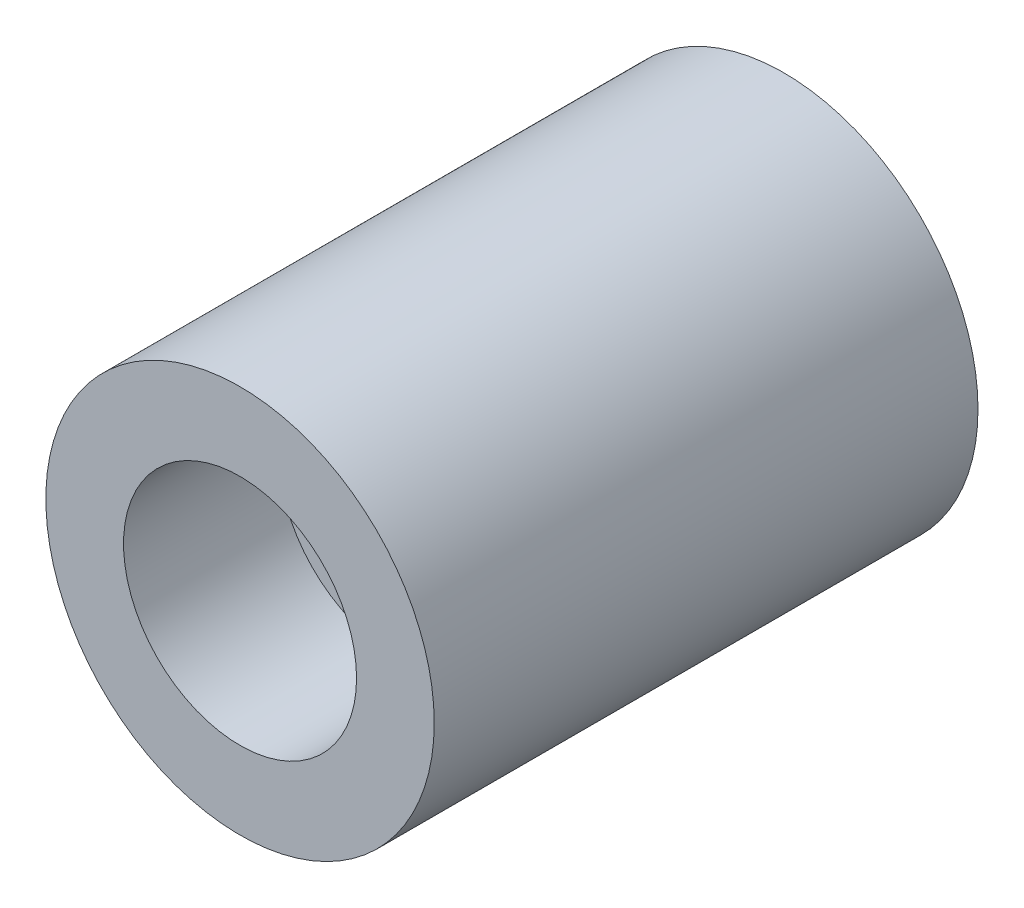
ISO-10303-21;
HEADER;
FILE_DESCRIPTION(('STEP AP214'),'2;1');
FILE_NAME('part.step','',(''),(''),'','','');
FILE_SCHEMA(('AUTOMOTIVE_DESIGN { 1 0 10303 214 1 1 1 1 }'));
ENDSEC;
DATA;
#1=APPLICATION_CONTEXT('core data for automotive mechanical design processes');
#2=APPLICATION_PROTOCOL_DEFINITION('international standard','automotive_design',2000,#1);
#3=PRODUCT_CONTEXT('',#1,'mechanical');
#4=PRODUCT('Part','Part','',(#3));
#5=PRODUCT_RELATED_PRODUCT_CATEGORY('part','',(#4));
#6=PRODUCT_DEFINITION_FORMATION('','',#4);
#7=PRODUCT_DEFINITION_CONTEXT('part definition',#1,'design');
#8=PRODUCT_DEFINITION('design','',#6,#7);
#9=PRODUCT_DEFINITION_SHAPE('','',#8);
#10=(LENGTH_UNIT() NAMED_UNIT(*) SI_UNIT(.MILLI.,.METRE.));
#11=(NAMED_UNIT(*) PLANE_ANGLE_UNIT() SI_UNIT($,.RADIAN.));
#12=(NAMED_UNIT(*) SI_UNIT($,.STERADIAN.) SOLID_ANGLE_UNIT());
#13=UNCERTAINTY_MEASURE_WITH_UNIT(LENGTH_MEASURE(1.E-05),#10,'distance_accuracy_value','');
#14=(GEOMETRIC_REPRESENTATION_CONTEXT(3) GLOBAL_UNCERTAINTY_ASSIGNED_CONTEXT((#13)) GLOBAL_UNIT_ASSIGNED_CONTEXT((#10,
#11,#12)) REPRESENTATION_CONTEXT('',''));
#15=CARTESIAN_POINT('',(0.,0.,0.));
#16=DIRECTION('',(0.,0.,1.));
#17=DIRECTION('',(1.,0.,0.));
#18=AXIS2_PLACEMENT_3D('',#15,#16,#17);
#19=CARTESIAN_POINT('',(0.,0.,140.));
#20=DIRECTION('',(0.,0.,-1.));
#21=DIRECTION('',(-1.,0.,0.));
#22=AXIS2_PLACEMENT_3D('',#19,#20,#21);
#23=CYLINDRICAL_SURFACE('',#22,50.);
#24=CARTESIAN_POINT('',(0.,0.,140.));
#25=DIRECTION('',(0.,0.,1.));
#26=DIRECTION('',(1.,0.,0.));
#27=AXIS2_PLACEMENT_3D('',#24,#25,#26);
#28=CIRCLE('',#27,50.);
#29=CARTESIAN_POINT('',(50.,0.,140.));
#30=VERTEX_POINT('',#29);
#31=EDGE_CURVE('E10',#30,#30,#28,.T.);
#32=ORIENTED_EDGE('',*,*,#31,.F.);
#33=EDGE_LOOP('',(#32));
#34=FACE_BOUND('',#33,.T.);
#35=CARTESIAN_POINT('',(0.,0.,0.));
#36=DIRECTION('',(0.,0.,1.));
#37=DIRECTION('',(1.,0.,0.));
#38=AXIS2_PLACEMENT_3D('',#35,#36,#37);
#39=CIRCLE('',#38,50.);
#40=CARTESIAN_POINT('',(50.,0.,0.));
#41=VERTEX_POINT('',#40);
#42=EDGE_CURVE('E36',#41,#41,#39,.T.);
#43=ORIENTED_EDGE('',*,*,#42,.T.);
#44=EDGE_LOOP('',(#43));
#45=FACE_BOUND('',#44,.T.);
#46=ADVANCED_FACE('F33',(#34,#45),#23,.T.);
#47=CARTESIAN_POINT('',(0.,0.,140.));
#48=DIRECTION('',(0.,0.,1.));
#49=DIRECTION('',(1.,0.,0.));
#50=AXIS2_PLACEMENT_3D('',#47,#48,#49);
#51=PLANE('',#50);
#52=CARTESIAN_POINT('',(0.,0.,140.));
#53=DIRECTION('',(0.,0.,1.));
#54=DIRECTION('',(1.,0.,0.));
#55=AXIS2_PLACEMENT_3D('',#52,#53,#54);
#56=CIRCLE('',#55,30.);
#57=CARTESIAN_POINT('',(30.,0.,140.));
#58=VERTEX_POINT('',#57);
#59=EDGE_CURVE('E45',#58,#58,#56,.T.);
#60=ORIENTED_EDGE('',*,*,#59,.F.);
#61=EDGE_LOOP('',(#60));
#62=FACE_BOUND('',#61,.T.);
#63=ORIENTED_EDGE('',*,*,#31,.T.);
#64=EDGE_LOOP('',(#63));
#65=FACE_BOUND('',#64,.T.);
#66=ADVANCED_FACE('F78',(#62,#65),#51,.T.);
#67=CARTESIAN_POINT('',(0.,0.,0.));
#68=DIRECTION('',(0.,0.,1.));
#69=DIRECTION('',(1.,0.,0.));
#70=AXIS2_PLACEMENT_3D('',#67,#68,#69);
#71=PLANE('',#70);
#72=ORIENTED_EDGE('',*,*,#42,.F.);
#73=EDGE_LOOP('',(#72));
#74=FACE_BOUND('',#73,.T.);
#75=ADVANCED_FACE('F74',(#74),#71,.F.);
#76=CARTESIAN_POINT('',(0.,0.,100.));
#77=DIRECTION('',(0.,0.,1.));
#78=DIRECTION('',(1.,0.,0.));
#79=AXIS2_PLACEMENT_3D('',#76,#77,#78);
#80=CYLINDRICAL_SURFACE('',#79,30.);
#81=CARTESIAN_POINT('',(0.,0.,100.));
#82=DIRECTION('',(0.,0.,1.));
#83=DIRECTION('',(1.,0.,0.));
#84=AXIS2_PLACEMENT_3D('',#81,#82,#83);
#85=CIRCLE('',#84,30.);
#86=CARTESIAN_POINT('',(30.,0.,100.));
#87=VERTEX_POINT('',#86);
#88=EDGE_CURVE('E43',#87,#87,#85,.T.);
#89=ORIENTED_EDGE('',*,*,#88,.F.);
#90=EDGE_LOOP('',(#89));
#91=FACE_BOUND('',#90,.T.);
#92=ORIENTED_EDGE('',*,*,#59,.T.);
#93=EDGE_LOOP('',(#92));
#94=FACE_BOUND('',#93,.T.);
#95=ADVANCED_FACE('F68',(#91,#94),#80,.F.);
#96=CARTESIAN_POINT('',(0.,0.,100.));
#97=DIRECTION('',(0.,0.,1.));
#98=DIRECTION('',(1.,0.,0.));
#99=AXIS2_PLACEMENT_3D('',#96,#97,#98);
#100=PLANE('',#99);
#101=CARTESIAN_POINT('',(0.,0.,100.));
#102=DIRECTION('',(0.,0.,1.));
#103=DIRECTION('',(1.,0.,0.));
#104=AXIS2_PLACEMENT_3D('',#101,#102,#103);
#105=CIRCLE('',#104,10.);
#106=CARTESIAN_POINT('',(10.,0.,100.));
#107=VERTEX_POINT('',#106);
#108=EDGE_CURVE('E51',#107,#107,#105,.T.);
#109=ORIENTED_EDGE('',*,*,#108,.F.);
#110=EDGE_LOOP('',(#109));
#111=FACE_BOUND('',#110,.T.);
#112=ORIENTED_EDGE('',*,*,#88,.T.);
#113=EDGE_LOOP('',(#112));
#114=FACE_BOUND('',#113,.T.);
#115=ADVANCED_FACE('F62',(#111,#114),#100,.T.);
#116=CARTESIAN_POINT('',(0.,0.,20.));
#117=DIRECTION('',(0.,0.,1.));
#118=DIRECTION('',(1.,0.,0.));
#119=AXIS2_PLACEMENT_3D('',#116,#117,#118);
#120=CYLINDRICAL_SURFACE('',#119,10.);
#121=CARTESIAN_POINT('',(0.,0.,20.));
#122=DIRECTION('',(0.,0.,1.));
#123=DIRECTION('',(1.,0.,0.));
#124=AXIS2_PLACEMENT_3D('',#121,#122,#123);
#125=CIRCLE('',#124,10.);
#126=CARTESIAN_POINT('',(10.,0.,20.));
#127=VERTEX_POINT('',#126);
#128=EDGE_CURVE('E48',#127,#127,#125,.T.);
#129=ORIENTED_EDGE('',*,*,#128,.F.);
#130=EDGE_LOOP('',(#129));
#131=FACE_BOUND('',#130,.T.);
#132=ORIENTED_EDGE('',*,*,#108,.T.);
#133=EDGE_LOOP('',(#132));
#134=FACE_BOUND('',#133,.T.);
#135=ADVANCED_FACE('F59',(#131,#134),#120,.F.);
#136=CARTESIAN_POINT('',(0.,0.,20.));
#137=DIRECTION('',(0.,0.,1.));
#138=DIRECTION('',(1.,0.,0.));
#139=AXIS2_PLACEMENT_3D('',#136,#137,#138);
#140=PLANE('',#139);
#141=ORIENTED_EDGE('',*,*,#128,.T.);
#142=EDGE_LOOP('',(#141));
#143=FACE_BOUND('',#142,.T.);
#144=ADVANCED_FACE('F57',(#143),#140,.T.);
#145=CLOSED_SHELL('',(#46,#66,#75,#95,#115,#135,#144));
#146=MANIFOLD_SOLID_BREP('B2',#145);
#147=ADVANCED_BREP_SHAPE_REPRESENTATION('',(#18,#146),#14);
#148=SHAPE_DEFINITION_REPRESENTATION(#9,#147);
ENDSEC;
END-ISO-10303-21;
